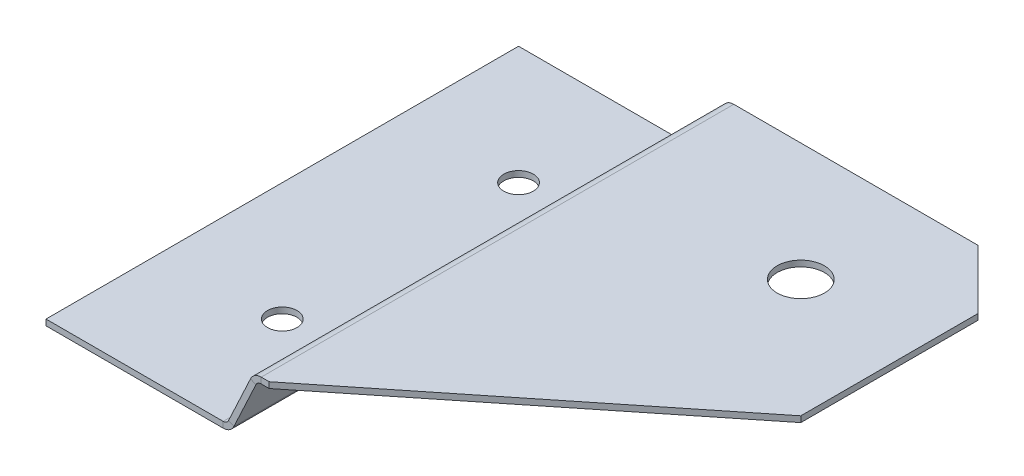
ISO-10303-21;
HEADER;
FILE_DESCRIPTION(('STEP AP214'),'2;1');
FILE_NAME('part.step','',(''),(''),'','','');
FILE_SCHEMA(('AUTOMOTIVE_DESIGN { 1 0 10303 214 1 1 1 1 }'));
ENDSEC;
DATA;
#1=APPLICATION_CONTEXT('core data for automotive mechanical design processes');
#2=APPLICATION_PROTOCOL_DEFINITION('international standard','automotive_design',2000,#1);
#3=PRODUCT_CONTEXT('',#1,'mechanical');
#4=PRODUCT('Part','Part','',(#3));
#5=PRODUCT_RELATED_PRODUCT_CATEGORY('part','',(#4));
#6=PRODUCT_DEFINITION_FORMATION('','',#4);
#7=PRODUCT_DEFINITION_CONTEXT('part definition',#1,'design');
#8=PRODUCT_DEFINITION('design','',#6,#7);
#9=PRODUCT_DEFINITION_SHAPE('','',#8);
#10=(LENGTH_UNIT() NAMED_UNIT(*) SI_UNIT(.MILLI.,.METRE.));
#11=(NAMED_UNIT(*) PLANE_ANGLE_UNIT() SI_UNIT($,.RADIAN.));
#12=(NAMED_UNIT(*) SI_UNIT($,.STERADIAN.) SOLID_ANGLE_UNIT());
#13=UNCERTAINTY_MEASURE_WITH_UNIT(LENGTH_MEASURE(1.E-05),#10,'distance_accuracy_value','');
#14=(GEOMETRIC_REPRESENTATION_CONTEXT(3) GLOBAL_UNCERTAINTY_ASSIGNED_CONTEXT((#13)) GLOBAL_UNIT_ASSIGNED_CONTEXT((#10,
#11,#12)) REPRESENTATION_CONTEXT('',''));
#15=CARTESIAN_POINT('',(0.,0.,0.));
#16=DIRECTION('',(0.,0.,1.));
#17=DIRECTION('',(1.,0.,0.));
#18=AXIS2_PLACEMENT_3D('',#15,#16,#17);
#19=CARTESIAN_POINT('',(-4.86211930977603,7.1183595245972,0.));
#20=DIRECTION('',(-0.906307787036651,0.422618261740697,0.));
#21=DIRECTION('',(0.,0.,1.));
#22=AXIS2_PLACEMENT_3D('',#19,#20,#21);
#23=PLANE('',#22);
#24=DIRECTION('',(0.422618261740697,0.906307787036651,0.));
#25=VECTOR('',#24,1.);
#26=CARTESIAN_POINT('',(-14.7936484606824,-14.1798734707641,20.));
#27=LINE('',#26,#25);
#28=CARTESIAN_POINT('',(-8.04684610648168,0.288690869129652,20.));
#29=VERTEX_POINT('',#28);
#30=CARTESIAN_POINT('',(-6.18790249035692,4.27520831874628,20.));
#31=VERTEX_POINT('',#30);
#32=EDGE_CURVE('E208',#29,#31,#27,.T.);
#33=ORIENTED_EDGE('',*,*,#32,.T.);
#34=DIRECTION('',(0.,0.,-1.));
#35=VECTOR('',#34,1.);
#36=CARTESIAN_POINT('',(-6.18790249035692,4.27520831874628,0.));
#37=LINE('',#36,#35);
#38=CARTESIAN_POINT('',(-6.18790249035693,4.27520831874628,-20.));
#39=VERTEX_POINT('',#38);
#40=EDGE_CURVE('E53',#31,#39,#37,.T.);
#41=ORIENTED_EDGE('',*,*,#40,.T.);
#42=DIRECTION('',(-0.422618261740697,-0.906307787036651,0.));
#43=VECTOR('',#42,1.);
#44=CARTESIAN_POINT('',(-14.7936484606824,-14.1798734707641,-20.));
#45=LINE('',#44,#43);
#46=CARTESIAN_POINT('',(-8.04684610648168,0.288690869129652,-20.));
#47=VERTEX_POINT('',#46);
#48=EDGE_CURVE('E269',#39,#47,#45,.T.);
#49=ORIENTED_EDGE('',*,*,#48,.T.);
#50=DIRECTION('',(0.,0.,-1.));
#51=VECTOR('',#50,1.);
#52=CARTESIAN_POINT('',(-8.04684610648168,0.288690869129653,0.));
#53=LINE('',#52,#51);
#54=EDGE_CURVE('E254',#29,#47,#53,.T.);
#55=ORIENTED_EDGE('',*,*,#54,.F.);
#56=EDGE_LOOP('',(#33,#41,#49,#55));
#57=FACE_BOUND('',#56,.T.);
#58=ADVANCED_FACE('F44',(#57),#23,.T.);
#59=CARTESIAN_POINT('',(-14.3404945671641,-14.3911826016345,20.));
#60=DIRECTION('',(0.,0.,1.));
#61=DIRECTION('',(0.422618261740697,0.906307787036651,0.));
#62=AXIS2_PLACEMENT_3D('',#59,#60,#61);
#63=PLANE('',#62);
#64=DIRECTION('',(0.422618261740697,0.906307787036651,0.));
#65=VECTOR('',#64,1.);
#66=CARTESIAN_POINT('',(-14.3404945671641,-14.3911826016345,20.));
#67=LINE('',#66,#65);
#68=CARTESIAN_POINT('',(-7.59369221296335,0.0773817382593027,20.));
#69=VERTEX_POINT('',#68);
#70=CARTESIAN_POINT('',(-5.7347485968386,4.06389918787593,20.));
#71=VERTEX_POINT('',#70);
#72=EDGE_CURVE('E266',#69,#71,#67,.T.);
#73=ORIENTED_EDGE('',*,*,#72,.T.);
#74=DIRECTION('',(-0.906307787036651,0.422618261740697,0.));
#75=VECTOR('',#74,1.);
#76=CARTESIAN_POINT('',(-5.7347485968386,4.06389918787594,20.));
#77=LINE('',#76,#75);
#78=EDGE_CURVE('E12',#71,#31,#77,.T.);
#79=ORIENTED_EDGE('',*,*,#78,.T.);
#80=ORIENTED_EDGE('',*,*,#32,.F.);
#81=DIRECTION('',(-0.906307787036651,0.422618261740697,0.));
#82=VECTOR('',#81,1.);
#83=CARTESIAN_POINT('',(-7.59369221296335,0.0773817382593031,20.));
#84=LINE('',#83,#82);
#85=EDGE_CURVE('E252',#69,#29,#84,.T.);
#86=ORIENTED_EDGE('',*,*,#85,.F.);
#87=EDGE_LOOP('',(#73,#79,#80,#86));
#88=FACE_BOUND('',#87,.T.);
#89=ADVANCED_FACE('F46',(#88),#63,.T.);
#90=CARTESIAN_POINT('',(-14.3404945671641,-14.3911826016344,-20.));
#91=DIRECTION('',(0.,0.,-1.));
#92=DIRECTION('',(-0.422618261740697,-0.906307787036651,0.));
#93=AXIS2_PLACEMENT_3D('',#90,#91,#92);
#94=PLANE('',#93);
#95=ORIENTED_EDGE('',*,*,#48,.F.);
#96=DIRECTION('',(0.906307787036651,-0.422618261740697,0.));
#97=VECTOR('',#96,1.);
#98=CARTESIAN_POINT('',(-5.7347485968386,4.06389918787594,-20.));
#99=LINE('',#98,#97);
#100=CARTESIAN_POINT('',(-5.7347485968386,4.06389918787593,-20.));
#101=VERTEX_POINT('',#100);
#102=EDGE_CURVE('E262',#39,#101,#99,.T.);
#103=ORIENTED_EDGE('',*,*,#102,.T.);
#104=DIRECTION('',(-0.422618261740697,-0.906307787036651,0.));
#105=VECTOR('',#104,1.);
#106=CARTESIAN_POINT('',(-14.3404945671641,-14.3911826016344,-20.));
#107=LINE('',#106,#105);
#108=CARTESIAN_POINT('',(-7.59369221296336,0.0773817382593049,-20.));
#109=VERTEX_POINT('',#108);
#110=EDGE_CURVE('E48',#101,#109,#107,.T.);
#111=ORIENTED_EDGE('',*,*,#110,.T.);
#112=DIRECTION('',(0.906307787036651,-0.422618261740697,0.));
#113=VECTOR('',#112,1.);
#114=CARTESIAN_POINT('',(-7.59369221296336,0.0773817382593049,-20.));
#115=LINE('',#114,#113);
#116=EDGE_CURVE('E257',#47,#109,#115,.T.);
#117=ORIENTED_EDGE('',*,*,#116,.F.);
#118=EDGE_LOOP('',(#95,#103,#111,#117));
#119=FACE_BOUND('',#118,.T.);
#120=ADVANCED_FACE('F287',(#119),#94,.T.);
#121=CARTESIAN_POINT('',(-4.4089654162577,6.90705039372686,0.));
#122=DIRECTION('',(-0.906307787036651,0.422618261740697,0.));
#123=DIRECTION('',(0.,0.,1.));
#124=AXIS2_PLACEMENT_3D('',#121,#122,#123);
#125=PLANE('',#124);
#126=DIRECTION('',(0.,0.,-1.));
#127=VECTOR('',#126,1.);
#128=CARTESIAN_POINT('',(-5.7347485968386,4.06389918787593,0.));
#129=LINE('',#128,#127);
#130=EDGE_CURVE('E260',#71,#101,#129,.T.);
#131=ORIENTED_EDGE('',*,*,#130,.F.);
#132=ORIENTED_EDGE('',*,*,#72,.F.);
#133=DIRECTION('',(0.,0.,-1.));
#134=VECTOR('',#133,1.);
#135=CARTESIAN_POINT('',(-7.59369221296335,0.0773817382593049,0.));
#136=LINE('',#135,#134);
#137=EDGE_CURVE('E249',#69,#109,#136,.T.);
#138=ORIENTED_EDGE('',*,*,#137,.T.);
#139=ORIENTED_EDGE('',*,*,#110,.F.);
#140=EDGE_LOOP('',(#131,#132,#138,#139));
#141=FACE_BOUND('',#140,.T.);
#142=ADVANCED_FACE('F285',(#141),#125,.F.);
#143=CARTESIAN_POINT('',(-13.5,-10.,-10.));
#144=DIRECTION('',(0.,1.,0.));
#145=DIRECTION('',(0.,0.,1.));
#146=AXIS2_PLACEMENT_3D('',#143,#144,#145);
#147=CYLINDRICAL_SURFACE('',#146,1.25);
#148=CARTESIAN_POINT('',(-13.5,0.,-10.));
#149=DIRECTION('',(0.,1.,0.));
#150=DIRECTION('',(0.,0.,1.));
#151=AXIS2_PLACEMENT_3D('',#148,#149,#150);
#152=CIRCLE('',#151,1.25);
#153=CARTESIAN_POINT('',(-13.5,0.,-8.75));
#154=VERTEX_POINT('',#153);
#155=EDGE_CURVE('E245',#154,#154,#152,.T.);
#156=ORIENTED_EDGE('',*,*,#155,.T.);
#157=EDGE_LOOP('',(#156));
#158=FACE_BOUND('',#157,.T.);
#159=CARTESIAN_POINT('',(-13.5,-0.5,-10.));
#160=DIRECTION('',(0.,1.,0.));
#161=DIRECTION('',(0.,0.,1.));
#162=AXIS2_PLACEMENT_3D('',#159,#160,#161);
#163=CIRCLE('',#162,1.25);
#164=CARTESIAN_POINT('',(-13.5,-0.5,-8.75));
#165=VERTEX_POINT('',#164);
#166=EDGE_CURVE('E231',#165,#165,#163,.T.);
#167=ORIENTED_EDGE('',*,*,#166,.F.);
#168=EDGE_LOOP('',(#167));
#169=FACE_BOUND('',#168,.T.);
#170=ADVANCED_FACE('F354',(#158,#169),#147,.F.);
#171=CARTESIAN_POINT('',(-13.5,-10.,10.));
#172=DIRECTION('',(0.,1.,0.));
#173=DIRECTION('',(0.,0.,1.));
#174=AXIS2_PLACEMENT_3D('',#171,#172,#173);
#175=CYLINDRICAL_SURFACE('',#174,1.25);
#176=CARTESIAN_POINT('',(-13.5,0.,10.));
#177=DIRECTION('',(0.,1.,0.));
#178=DIRECTION('',(0.,0.,1.));
#179=AXIS2_PLACEMENT_3D('',#176,#177,#178);
#180=CIRCLE('',#179,1.25);
#181=CARTESIAN_POINT('',(-13.5,0.,11.25));
#182=VERTEX_POINT('',#181);
#183=EDGE_CURVE('E242',#182,#182,#180,.T.);
#184=ORIENTED_EDGE('',*,*,#183,.T.);
#185=EDGE_LOOP('',(#184));
#186=FACE_BOUND('',#185,.T.);
#187=CARTESIAN_POINT('',(-13.5,-0.5,10.));
#188=DIRECTION('',(0.,1.,0.));
#189=DIRECTION('',(0.,0.,1.));
#190=AXIS2_PLACEMENT_3D('',#187,#188,#189);
#191=CIRCLE('',#190,1.25);
#192=CARTESIAN_POINT('',(-13.5,-0.5,11.25));
#193=VERTEX_POINT('',#192);
#194=EDGE_CURVE('E234',#193,#193,#191,.T.);
#195=ORIENTED_EDGE('',*,*,#194,.F.);
#196=EDGE_LOOP('',(#195));
#197=FACE_BOUND('',#196,.T.);
#198=ADVANCED_FACE('F375',(#186,#197),#175,.F.);
#199=CARTESIAN_POINT('',(-23.5,-0.5,-20.));
#200=DIRECTION('',(-1.,0.,0.));
#201=DIRECTION('',(0.,0.,1.));
#202=AXIS2_PLACEMENT_3D('',#199,#200,#201);
#203=PLANE('',#202);
#204=DIRECTION('',(0.,0.,1.));
#205=VECTOR('',#204,1.);
#206=CARTESIAN_POINT('',(-23.5,0.,-20.));
#207=LINE('',#206,#205);
#208=CARTESIAN_POINT('',(-23.5,0.,-20.));
#209=VERTEX_POINT('',#208);
#210=CARTESIAN_POINT('',(-23.5,0.,20.));
#211=VERTEX_POINT('',#210);
#212=EDGE_CURVE('E214',#209,#211,#207,.T.);
#213=ORIENTED_EDGE('',*,*,#212,.F.);
#214=DIRECTION('',(0.,1.,0.));
#215=VECTOR('',#214,1.);
#216=CARTESIAN_POINT('',(-23.5,-0.5,-20.));
#217=LINE('',#216,#215);
#218=CARTESIAN_POINT('',(-23.5,-0.5,-20.));
#219=VERTEX_POINT('',#218);
#220=EDGE_CURVE('E205',#219,#209,#217,.T.);
#221=ORIENTED_EDGE('',*,*,#220,.F.);
#222=DIRECTION('',(0.,0.,1.));
#223=VECTOR('',#222,1.);
#224=CARTESIAN_POINT('',(-23.5,-0.5,-20.));
#225=LINE('',#224,#223);
#226=CARTESIAN_POINT('',(-23.5,-0.5,20.));
#227=VERTEX_POINT('',#226);
#228=EDGE_CURVE('E239',#219,#227,#225,.T.);
#229=ORIENTED_EDGE('',*,*,#228,.T.);
#230=DIRECTION('',(0.,1.,0.));
#231=VECTOR('',#230,1.);
#232=CARTESIAN_POINT('',(-23.5,-0.5,20.));
#233=LINE('',#232,#231);
#234=EDGE_CURVE('E237',#227,#211,#233,.T.);
#235=ORIENTED_EDGE('',*,*,#234,.T.);
#236=EDGE_LOOP('',(#213,#221,#229,#235));
#237=FACE_BOUND('',#236,.T.);
#238=ADVANCED_FACE('F371',(#237),#203,.T.);
#239=CARTESIAN_POINT('',(0.,-0.5,0.));
#240=DIRECTION('',(0.,1.,0.));
#241=DIRECTION('',(0.,0.,1.));
#242=AXIS2_PLACEMENT_3D('',#239,#240,#241);
#243=PLANE('',#242);
#244=DIRECTION('',(0.,0.,-1.));
#245=VECTOR('',#244,1.);
#246=CARTESIAN_POINT('',(-8.50000000000001,-0.5,0.));
#247=LINE('',#246,#245);
#248=CARTESIAN_POINT('',(-8.5,-0.500000000000001,20.));
#249=VERTEX_POINT('',#248);
#250=CARTESIAN_POINT('',(-8.5,-0.5,-20.));
#251=VERTEX_POINT('',#250);
#252=EDGE_CURVE('E201',#249,#251,#247,.T.);
#253=ORIENTED_EDGE('',*,*,#252,.F.);
#254=DIRECTION('',(1.,0.,0.));
#255=VECTOR('',#254,1.);
#256=CARTESIAN_POINT('',(-23.5,-0.5,20.));
#257=LINE('',#256,#255);
#258=EDGE_CURVE('E228',#227,#249,#257,.T.);
#259=ORIENTED_EDGE('',*,*,#258,.F.);
#260=ORIENTED_EDGE('',*,*,#228,.F.);
#261=DIRECTION('',(-1.,0.,0.));
#262=VECTOR('',#261,1.);
#263=CARTESIAN_POINT('',(-23.5,-0.5,-20.));
#264=LINE('',#263,#262);
#265=EDGE_CURVE('E209',#251,#219,#264,.T.);
#266=ORIENTED_EDGE('',*,*,#265,.F.);
#267=EDGE_LOOP('',(#253,#259,#260,#266));
#268=FACE_BOUND('',#267,.T.);
#269=ORIENTED_EDGE('',*,*,#194,.T.);
#270=EDGE_LOOP('',(#269));
#271=FACE_BOUND('',#270,.T.);
#272=ORIENTED_EDGE('',*,*,#166,.T.);
#273=EDGE_LOOP('',(#272));
#274=FACE_BOUND('',#273,.T.);
#275=ADVANCED_FACE('F367',(#268,#271,#274),#243,.F.);
#276=CARTESIAN_POINT('',(-23.5,-0.5,20.));
#277=DIRECTION('',(0.,0.,1.));
#278=DIRECTION('',(1.,0.,0.));
#279=AXIS2_PLACEMENT_3D('',#276,#277,#278);
#280=PLANE('',#279);
#281=ORIENTED_EDGE('',*,*,#258,.T.);
#282=DIRECTION('',(0.,1.,0.));
#283=VECTOR('',#282,1.);
#284=CARTESIAN_POINT('',(-8.5,-0.5,20.));
#285=LINE('',#284,#283);
#286=CARTESIAN_POINT('',(-8.5,0.,20.));
#287=VERTEX_POINT('',#286);
#288=EDGE_CURVE('E225',#249,#287,#285,.T.);
#289=ORIENTED_EDGE('',*,*,#288,.T.);
#290=DIRECTION('',(1.,0.,0.));
#291=VECTOR('',#290,1.);
#292=CARTESIAN_POINT('',(-23.5,0.,20.));
#293=LINE('',#292,#291);
#294=EDGE_CURVE('E222',#211,#287,#293,.T.);
#295=ORIENTED_EDGE('',*,*,#294,.F.);
#296=ORIENTED_EDGE('',*,*,#234,.F.);
#297=EDGE_LOOP('',(#281,#289,#295,#296));
#298=FACE_BOUND('',#297,.T.);
#299=ADVANCED_FACE('F363',(#298),#280,.T.);
#300=CARTESIAN_POINT('',(0.,0.,0.));
#301=DIRECTION('',(0.,1.,0.));
#302=DIRECTION('',(0.,0.,1.));
#303=AXIS2_PLACEMENT_3D('',#300,#301,#302);
#304=PLANE('',#303);
#305=ORIENTED_EDGE('',*,*,#155,.F.);
#306=EDGE_LOOP('',(#305));
#307=FACE_BOUND('',#306,.T.);
#308=ORIENTED_EDGE('',*,*,#183,.F.);
#309=EDGE_LOOP('',(#308));
#310=FACE_BOUND('',#309,.T.);
#311=ORIENTED_EDGE('',*,*,#294,.T.);
#312=DIRECTION('',(0.,0.,-1.));
#313=VECTOR('',#312,1.);
#314=CARTESIAN_POINT('',(-8.50000000000001,0.,0.));
#315=LINE('',#314,#313);
#316=CARTESIAN_POINT('',(-8.50000000000001,0.,-20.));
#317=VERTEX_POINT('',#316);
#318=EDGE_CURVE('E219',#287,#317,#315,.T.);
#319=ORIENTED_EDGE('',*,*,#318,.T.);
#320=DIRECTION('',(-1.,0.,0.));
#321=VECTOR('',#320,1.);
#322=CARTESIAN_POINT('',(-23.5,0.,-20.));
#323=LINE('',#322,#321);
#324=EDGE_CURVE('E217',#317,#209,#323,.T.);
#325=ORIENTED_EDGE('',*,*,#324,.T.);
#326=ORIENTED_EDGE('',*,*,#212,.T.);
#327=EDGE_LOOP('',(#311,#319,#325,#326));
#328=FACE_BOUND('',#327,.T.);
#329=ADVANCED_FACE('F359',(#307,#310,#328),#304,.T.);
#330=CARTESIAN_POINT('',(-23.5,-0.5,-20.));
#331=DIRECTION('',(0.,0.,-1.));
#332=DIRECTION('',(-1.,0.,0.));
#333=AXIS2_PLACEMENT_3D('',#330,#331,#332);
#334=PLANE('',#333);
#335=ORIENTED_EDGE('',*,*,#324,.F.);
#336=DIRECTION('',(0.,-1.,0.));
#337=VECTOR('',#336,1.);
#338=CARTESIAN_POINT('',(-8.50000000000001,-0.5,-20.));
#339=LINE('',#338,#337);
#340=EDGE_CURVE('E211',#317,#251,#339,.T.);
#341=ORIENTED_EDGE('',*,*,#340,.T.);
#342=ORIENTED_EDGE('',*,*,#265,.T.);
#343=ORIENTED_EDGE('',*,*,#220,.T.);
#344=EDGE_LOOP('',(#335,#341,#342,#343));
#345=FACE_BOUND('',#344,.T.);
#346=ADVANCED_FACE('F355',(#345),#334,.T.);
#347=CARTESIAN_POINT('',(-8.5,0.5,20.));
#348=DIRECTION('',(0.,0.,1.));
#349=DIRECTION('',(1.,0.,0.));
#350=AXIS2_PLACEMENT_3D('',#347,#348,#349);
#351=PLANE('',#350);
#352=ORIENTED_EDGE('',*,*,#85,.T.);
#353=CARTESIAN_POINT('',(-8.5,0.5,20.));
#354=DIRECTION('',(0.,0.,1.));
#355=DIRECTION('',(1.,0.,0.));
#356=AXIS2_PLACEMENT_3D('',#353,#354,#355);
#357=CIRCLE('',#356,0.5);
#358=EDGE_CURVE('E191',#29,#287,#357,.F.);
#359=ORIENTED_EDGE('',*,*,#358,.T.);
#360=ORIENTED_EDGE('',*,*,#288,.F.);
#361=CARTESIAN_POINT('',(-8.5,0.5,20.));
#362=DIRECTION('',(0.,0.,-1.));
#363=DIRECTION('',(1.,0.,0.));
#364=AXIS2_PLACEMENT_3D('',#361,#362,#363);
#365=CIRCLE('',#364,1.);
#366=EDGE_CURVE('E195',#69,#249,#365,.T.);
#367=ORIENTED_EDGE('',*,*,#366,.F.);
#368=EDGE_LOOP('',(#352,#359,#360,#367));
#369=FACE_BOUND('',#368,.T.);
#370=ADVANCED_FACE('F358',(#369),#351,.T.);
#371=CARTESIAN_POINT('',(-8.50000000000001,0.5,-20.));
#372=DIRECTION('',(0.,0.,-1.));
#373=DIRECTION('',(-1.,0.,0.));
#374=AXIS2_PLACEMENT_3D('',#371,#372,#373);
#375=PLANE('',#374);
#376=CARTESIAN_POINT('',(-8.50000000000001,0.5,-20.));
#377=DIRECTION('',(0.,0.,1.));
#378=DIRECTION('',(1.,0.,0.));
#379=AXIS2_PLACEMENT_3D('',#376,#377,#378);
#380=CIRCLE('',#379,0.5);
#381=EDGE_CURVE('E199',#317,#47,#380,.T.);
#382=ORIENTED_EDGE('',*,*,#381,.T.);
#383=ORIENTED_EDGE('',*,*,#116,.T.);
#384=CARTESIAN_POINT('',(-8.50000000000001,0.5,-20.));
#385=DIRECTION('',(0.,0.,1.));
#386=DIRECTION('',(-1.,0.,0.));
#387=AXIS2_PLACEMENT_3D('',#384,#385,#386);
#388=CIRCLE('',#387,1.);
#389=EDGE_CURVE('E198',#251,#109,#388,.T.);
#390=ORIENTED_EDGE('',*,*,#389,.F.);
#391=ORIENTED_EDGE('',*,*,#340,.F.);
#392=EDGE_LOOP('',(#382,#383,#390,#391));
#393=FACE_BOUND('',#392,.T.);
#394=ADVANCED_FACE('F383',(#393),#375,.T.);
#395=CARTESIAN_POINT('',(-8.50000000000001,0.5,-40.014745578505));
#396=DIRECTION('',(0.,0.,1.));
#397=DIRECTION('',(1.,0.,0.));
#398=AXIS2_PLACEMENT_3D('',#395,#396,#397);
#399=CYLINDRICAL_SURFACE('',#398,1.);
#400=ORIENTED_EDGE('',*,*,#252,.T.);
#401=ORIENTED_EDGE('',*,*,#389,.T.);
#402=ORIENTED_EDGE('',*,*,#137,.F.);
#403=ORIENTED_EDGE('',*,*,#366,.T.);
#404=EDGE_LOOP('',(#400,#401,#402,#403));
#405=FACE_BOUND('',#404,.T.);
#406=ADVANCED_FACE('F386',(#405),#399,.T.);
#407=CARTESIAN_POINT('',(-8.50000000000001,0.5,-40.014745578505));
#408=DIRECTION('',(0.,0.,1.));
#409=DIRECTION('',(1.,0.,0.));
#410=AXIS2_PLACEMENT_3D('',#407,#408,#409);
#411=CYLINDRICAL_SURFACE('',#410,0.5);
#412=ORIENTED_EDGE('',*,*,#318,.F.);
#413=ORIENTED_EDGE('',*,*,#358,.F.);
#414=ORIENTED_EDGE('',*,*,#54,.T.);
#415=ORIENTED_EDGE('',*,*,#381,.F.);
#416=EDGE_LOOP('',(#412,#413,#414,#415));
#417=FACE_BOUND('',#416,.T.);
#418=ADVANCED_FACE('F391',(#417),#411,.F.);
#419=CARTESIAN_POINT('',(-5.28159470332027,3.85259005700558,20.));
#420=DIRECTION('',(0.,0.,-1.));
#421=DIRECTION('',(-1.,0.,0.));
#422=AXIS2_PLACEMENT_3D('',#419,#420,#421);
#423=PLANE('',#422);
#424=DIRECTION('',(0.,1.,0.));
#425=VECTOR('',#424,1.);
#426=CARTESIAN_POINT('',(-5.28159470332027,4.35259005700559,20.));
#427=LINE('',#426,#425);
#428=CARTESIAN_POINT('',(-5.28159470332027,4.35259005700558,20.));
#429=VERTEX_POINT('',#428);
#430=CARTESIAN_POINT('',(-5.28159470332027,4.85259005700558,20.));
#431=VERTEX_POINT('',#430);
#432=EDGE_CURVE('E154',#429,#431,#427,.T.);
#433=ORIENTED_EDGE('',*,*,#432,.T.);
#434=CARTESIAN_POINT('',(-5.28159470332027,3.85259005700558,20.));
#435=DIRECTION('',(0.,0.,1.));
#436=DIRECTION('',(1.,0.,0.));
#437=AXIS2_PLACEMENT_3D('',#434,#435,#436);
#438=CIRCLE('',#437,1.);
#439=EDGE_CURVE('E61',#431,#31,#438,.T.);
#440=ORIENTED_EDGE('',*,*,#439,.T.);
#441=ORIENTED_EDGE('',*,*,#78,.F.);
#442=CARTESIAN_POINT('',(-5.28159470332027,3.85259005700558,20.));
#443=DIRECTION('',(0.,0.,1.));
#444=DIRECTION('',(-1.,0.,0.));
#445=AXIS2_PLACEMENT_3D('',#442,#443,#444);
#446=CIRCLE('',#445,0.5);
#447=EDGE_CURVE('E184',#429,#71,#446,.T.);
#448=ORIENTED_EDGE('',*,*,#447,.F.);
#449=EDGE_LOOP('',(#433,#440,#441,#448));
#450=FACE_BOUND('',#449,.T.);
#451=ADVANCED_FACE('F278',(#450),#423,.F.);
#452=CARTESIAN_POINT('',(-5.28159470332028,3.85259005700559,-20.));
#453=DIRECTION('',(0.,0.,1.));
#454=DIRECTION('',(1.,0.,0.));
#455=AXIS2_PLACEMENT_3D('',#452,#453,#454);
#456=PLANE('',#455);
#457=CARTESIAN_POINT('',(-5.28159470332028,3.85259005700559,-20.));
#458=DIRECTION('',(0.,0.,1.));
#459=DIRECTION('',(1.,0.,0.));
#460=AXIS2_PLACEMENT_3D('',#457,#458,#459);
#461=CIRCLE('',#460,1.);
#462=CARTESIAN_POINT('',(-5.28159470332027,4.85259005700558,-20.));
#463=VERTEX_POINT('',#462);
#464=EDGE_CURVE('E188',#39,#463,#461,.F.);
#465=ORIENTED_EDGE('',*,*,#464,.T.);
#466=DIRECTION('',(0.,-1.,0.));
#467=VECTOR('',#466,1.);
#468=CARTESIAN_POINT('',(-5.28159470332027,4.35259005700559,-20.));
#469=LINE('',#468,#467);
#470=CARTESIAN_POINT('',(-5.28159470332027,4.35259005700558,-20.));
#471=VERTEX_POINT('',#470);
#472=EDGE_CURVE('E173',#463,#471,#469,.T.);
#473=ORIENTED_EDGE('',*,*,#472,.T.);
#474=CARTESIAN_POINT('',(-5.28159470332028,3.85259005700559,-20.));
#475=DIRECTION('',(0.,0.,-1.));
#476=DIRECTION('',(1.,0.,0.));
#477=AXIS2_PLACEMENT_3D('',#474,#475,#476);
#478=CIRCLE('',#477,0.5);
#479=EDGE_CURVE('E187',#101,#471,#478,.T.);
#480=ORIENTED_EDGE('',*,*,#479,.F.);
#481=ORIENTED_EDGE('',*,*,#102,.F.);
#482=EDGE_LOOP('',(#465,#473,#480,#481));
#483=FACE_BOUND('',#482,.T.);
#484=ADVANCED_FACE('F290',(#483),#456,.F.);
#485=CARTESIAN_POINT('',(-5.28159470332028,3.85259005700559,-40.0239747662338));
#486=DIRECTION('',(0.,0.,1.));
#487=DIRECTION('',(1.,0.,0.));
#488=AXIS2_PLACEMENT_3D('',#485,#486,#487);
#489=CYLINDRICAL_SURFACE('',#488,0.5);
#490=ORIENTED_EDGE('',*,*,#130,.T.);
#491=ORIENTED_EDGE('',*,*,#479,.T.);
#492=DIRECTION('',(0.,0.,-1.));
#493=VECTOR('',#492,1.);
#494=CARTESIAN_POINT('',(-5.28159470332027,4.35259005700558,0.));
#495=LINE('',#494,#493);
#496=EDGE_CURVE('E283',#429,#471,#495,.T.);
#497=ORIENTED_EDGE('',*,*,#496,.F.);
#498=ORIENTED_EDGE('',*,*,#447,.T.);
#499=EDGE_LOOP('',(#490,#491,#497,#498));
#500=FACE_BOUND('',#499,.T.);
#501=ADVANCED_FACE('F281',(#500),#489,.F.);
#502=CARTESIAN_POINT('',(-5.28159470332028,3.85259005700559,-40.0239747662338));
#503=DIRECTION('',(0.,0.,1.));
#504=DIRECTION('',(1.,0.,0.));
#505=AXIS2_PLACEMENT_3D('',#502,#503,#504);
#506=CYLINDRICAL_SURFACE('',#505,1.);
#507=ORIENTED_EDGE('',*,*,#40,.F.);
#508=ORIENTED_EDGE('',*,*,#439,.F.);
#509=DIRECTION('',(0.,0.,-1.));
#510=VECTOR('',#509,1.);
#511=CARTESIAN_POINT('',(-5.28159470332027,4.85259005700558,0.));
#512=LINE('',#511,#510);
#513=EDGE_CURVE('E177',#431,#463,#512,.T.);
#514=ORIENTED_EDGE('',*,*,#513,.T.);
#515=ORIENTED_EDGE('',*,*,#464,.F.);
#516=EDGE_LOOP('',(#507,#508,#514,#515));
#517=FACE_BOUND('',#516,.T.);
#518=ADVANCED_FACE('F292',(#517),#506,.T.);
#519=CARTESIAN_POINT('',(-4.60881885423965,4.35259005700558,20.));
#520=DIRECTION('',(0.624695047554425,0.,0.78086880944303));
#521=DIRECTION('',(0.78086880944303,0.,-0.624695047554425));
#522=AXIS2_PLACEMENT_3D('',#519,#520,#521);
#523=PLANE('',#522);
#524=DIRECTION('',(0.78086880944303,0.,-0.624695047554424));
#525=VECTOR('',#524,1.);
#526=CARTESIAN_POINT('',(-4.60881885423965,4.85259005700558,20.));
#527=LINE('',#526,#525);
#528=CARTESIAN_POINT('',(-4.60881885423965,4.85259005700558,20.));
#529=VERTEX_POINT('',#528);
#530=CARTESIAN_POINT('',(20.3911811457603,4.85259005700558,0.));
#531=VERTEX_POINT('',#530);
#532=EDGE_CURVE('E165',#529,#531,#527,.T.);
#533=ORIENTED_EDGE('',*,*,#532,.F.);
#534=DIRECTION('',(0.,1.,0.));
#535=VECTOR('',#534,1.);
#536=CARTESIAN_POINT('',(-4.60881885423965,4.35259005700558,20.));
#537=LINE('',#536,#535);
#538=CARTESIAN_POINT('',(-4.60881885423965,4.35259005700558,20.));
#539=VERTEX_POINT('',#538);
#540=EDGE_CURVE('E152',#539,#529,#537,.T.);
#541=ORIENTED_EDGE('',*,*,#540,.F.);
#542=DIRECTION('',(0.78086880944303,0.,-0.624695047554424));
#543=VECTOR('',#542,1.);
#544=CARTESIAN_POINT('',(-4.60881885423965,4.35259005700558,20.));
#545=LINE('',#544,#543);
#546=CARTESIAN_POINT('',(20.3911811457603,4.35259005700558,0.));
#547=VERTEX_POINT('',#546);
#548=EDGE_CURVE('E163',#539,#547,#545,.T.);
#549=ORIENTED_EDGE('',*,*,#548,.T.);
#550=DIRECTION('',(0.,1.,0.));
#551=VECTOR('',#550,1.);
#552=CARTESIAN_POINT('',(20.3911811457603,4.35259005700558,0.));
#553=LINE('',#552,#551);
#554=EDGE_CURVE('E172',#547,#531,#553,.T.);
#555=ORIENTED_EDGE('',*,*,#554,.T.);
#556=EDGE_LOOP('',(#533,#541,#549,#555));
#557=FACE_BOUND('',#556,.T.);
#558=ADVANCED_FACE('F162',(#557),#523,.T.);
#559=CARTESIAN_POINT('',(20.3911811457603,4.35259005700559,-15.));
#560=DIRECTION('',(1.,0.,0.));
#561=DIRECTION('',(0.,0.,-1.));
#562=AXIS2_PLACEMENT_3D('',#559,#560,#561);
#563=PLANE('',#562);
#564=DIRECTION('',(0.,0.,-1.));
#565=VECTOR('',#564,1.);
#566=CARTESIAN_POINT('',(20.3911811457603,4.85259005700559,-15.));
#567=LINE('',#566,#565);
#568=CARTESIAN_POINT('',(20.3911811457603,4.85259005700559,-15.));
#569=VERTEX_POINT('',#568);
#570=EDGE_CURVE('E330',#531,#569,#567,.T.);
#571=ORIENTED_EDGE('',*,*,#570,.F.);
#572=ORIENTED_EDGE('',*,*,#554,.F.);
#573=DIRECTION('',(0.,0.,-1.));
#574=VECTOR('',#573,1.);
#575=CARTESIAN_POINT('',(20.3911811457603,4.35259005700559,-15.));
#576=LINE('',#575,#574);
#577=CARTESIAN_POINT('',(20.3911811457603,4.35259005700559,-15.));
#578=VERTEX_POINT('',#577);
#579=EDGE_CURVE('E171',#547,#578,#576,.T.);
#580=ORIENTED_EDGE('',*,*,#579,.T.);
#581=DIRECTION('',(0.,1.,0.));
#582=VECTOR('',#581,1.);
#583=CARTESIAN_POINT('',(20.3911811457603,4.35259005700559,-15.));
#584=LINE('',#583,#582);
#585=EDGE_CURVE('E326',#578,#569,#584,.T.);
#586=ORIENTED_EDGE('',*,*,#585,.T.);
#587=EDGE_LOOP('',(#571,#572,#580,#586));
#588=FACE_BOUND('',#587,.T.);
#589=ADVANCED_FACE('F329',(#588),#563,.T.);
#590=CARTESIAN_POINT('',(15.3911811457603,4.35259005700559,-20.));
#591=DIRECTION('',(0.707106781186548,0.,-0.707106781186548));
#592=DIRECTION('',(-0.707106781186548,0.,-0.707106781186547));
#593=AXIS2_PLACEMENT_3D('',#590,#591,#592);
#594=PLANE('',#593);
#595=DIRECTION('',(-0.707106781186548,0.,-0.707106781186547));
#596=VECTOR('',#595,1.);
#597=CARTESIAN_POINT('',(15.3911811457603,4.85259005700559,-20.));
#598=LINE('',#597,#596);
#599=CARTESIAN_POINT('',(15.3911811457603,4.85259005700559,-20.));
#600=VERTEX_POINT('',#599);
#601=EDGE_CURVE('E303',#569,#600,#598,.T.);
#602=ORIENTED_EDGE('',*,*,#601,.F.);
#603=ORIENTED_EDGE('',*,*,#585,.F.);
#604=DIRECTION('',(-0.707106781186548,0.,-0.707106781186547));
#605=VECTOR('',#604,1.);
#606=CARTESIAN_POINT('',(15.3911811457603,4.35259005700559,-20.));
#607=LINE('',#606,#605);
#608=CARTESIAN_POINT('',(15.3911811457603,4.35259005700559,-20.));
#609=VERTEX_POINT('',#608);
#610=EDGE_CURVE('E324',#578,#609,#607,.T.);
#611=ORIENTED_EDGE('',*,*,#610,.T.);
#612=DIRECTION('',(0.,1.,0.));
#613=VECTOR('',#612,1.);
#614=CARTESIAN_POINT('',(15.3911811457603,4.35259005700559,-20.));
#615=LINE('',#614,#613);
#616=EDGE_CURVE('E310',#609,#600,#615,.T.);
#617=ORIENTED_EDGE('',*,*,#616,.T.);
#618=EDGE_LOOP('',(#602,#603,#611,#617));
#619=FACE_BOUND('',#618,.T.);
#620=ADVANCED_FACE('F334',(#619),#594,.T.);
#621=CARTESIAN_POINT('',(10.3911811457604,-5.14740994299442,-10.));
#622=DIRECTION('',(0.,1.,0.));
#623=DIRECTION('',(0.,0.,1.));
#624=AXIS2_PLACEMENT_3D('',#621,#622,#623);
#625=CYLINDRICAL_SURFACE('',#624,2.);
#626=CARTESIAN_POINT('',(10.3911811457603,4.85259005700558,-10.));
#627=DIRECTION('',(0.,1.,0.));
#628=DIRECTION('',(0.,0.,1.));
#629=AXIS2_PLACEMENT_3D('',#626,#627,#628);
#630=CIRCLE('',#629,2.);
#631=CARTESIAN_POINT('',(10.3911811457603,4.85259005700558,-7.99999999999999));
#632=VERTEX_POINT('',#631);
#633=EDGE_CURVE('E320',#632,#632,#630,.T.);
#634=ORIENTED_EDGE('',*,*,#633,.T.);
#635=EDGE_LOOP('',(#634));
#636=FACE_BOUND('',#635,.T.);
#637=CARTESIAN_POINT('',(10.3911811457603,4.35259005700558,-10.));
#638=DIRECTION('',(0.,1.,0.));
#639=DIRECTION('',(0.,0.,1.));
#640=AXIS2_PLACEMENT_3D('',#637,#638,#639);
#641=CIRCLE('',#640,2.);
#642=CARTESIAN_POINT('',(10.3911811457603,4.35259005700558,-7.99999999999999));
#643=VERTEX_POINT('',#642);
#644=EDGE_CURVE('E314',#643,#643,#641,.T.);
#645=ORIENTED_EDGE('',*,*,#644,.F.);
#646=EDGE_LOOP('',(#645));
#647=FACE_BOUND('',#646,.T.);
#648=ADVANCED_FACE('F336',(#636,#647),#625,.F.);
#649=CARTESIAN_POINT('',(-3.10881885423965,4.35259005700558,0.));
#650=DIRECTION('',(0.,1.,0.));
#651=DIRECTION('',(0.,0.,1.));
#652=AXIS2_PLACEMENT_3D('',#649,#650,#651);
#653=PLANE('',#652);
#654=ORIENTED_EDGE('',*,*,#644,.T.);
#655=EDGE_LOOP('',(#654));
#656=FACE_BOUND('',#655,.T.);
#657=DIRECTION('',(1.,0.,0.));
#658=VECTOR('',#657,1.);
#659=CARTESIAN_POINT('',(-26.6088188542397,4.35259005700558,20.));
#660=LINE('',#659,#658);
#661=EDGE_CURVE('E149',#429,#539,#660,.T.);
#662=ORIENTED_EDGE('',*,*,#661,.F.);
#663=ORIENTED_EDGE('',*,*,#496,.T.);
#664=DIRECTION('',(-1.,0.,0.));
#665=VECTOR('',#664,1.);
#666=CARTESIAN_POINT('',(-26.6088188542397,4.35259005700559,-20.));
#667=LINE('',#666,#665);
#668=EDGE_CURVE('E309',#609,#471,#667,.T.);
#669=ORIENTED_EDGE('',*,*,#668,.F.);
#670=ORIENTED_EDGE('',*,*,#610,.F.);
#671=ORIENTED_EDGE('',*,*,#579,.F.);
#672=ORIENTED_EDGE('',*,*,#548,.F.);
#673=EDGE_LOOP('',(#662,#663,#669,#670,#671,#672));
#674=FACE_BOUND('',#673,.T.);
#675=ADVANCED_FACE('F168',(#656,#674),#653,.F.);
#676=CARTESIAN_POINT('',(-26.6088188542397,4.35259005700559,-20.));
#677=DIRECTION('',(0.,0.,-1.));
#678=DIRECTION('',(-1.,0.,0.));
#679=AXIS2_PLACEMENT_3D('',#676,#677,#678);
#680=PLANE('',#679);
#681=ORIENTED_EDGE('',*,*,#472,.F.);
#682=DIRECTION('',(-1.,0.,0.));
#683=VECTOR('',#682,1.);
#684=CARTESIAN_POINT('',(-26.6088188542397,4.85259005700558,-20.));
#685=LINE('',#684,#683);
#686=EDGE_CURVE('E158',#600,#463,#685,.T.);
#687=ORIENTED_EDGE('',*,*,#686,.F.);
#688=ORIENTED_EDGE('',*,*,#616,.F.);
#689=ORIENTED_EDGE('',*,*,#668,.T.);
#690=EDGE_LOOP('',(#681,#687,#688,#689));
#691=FACE_BOUND('',#690,.T.);
#692=ADVANCED_FACE('F307',(#691),#680,.T.);
#693=CARTESIAN_POINT('',(-3.10881885423965,4.85259005700558,0.));
#694=DIRECTION('',(0.,1.,0.));
#695=DIRECTION('',(0.,0.,1.));
#696=AXIS2_PLACEMENT_3D('',#693,#694,#695);
#697=PLANE('',#696);
#698=ORIENTED_EDGE('',*,*,#513,.F.);
#699=DIRECTION('',(1.,0.,0.));
#700=VECTOR('',#699,1.);
#701=CARTESIAN_POINT('',(-26.6088188542397,4.85259005700558,20.));
#702=LINE('',#701,#700);
#703=EDGE_CURVE('E297',#431,#529,#702,.T.);
#704=ORIENTED_EDGE('',*,*,#703,.T.);
#705=ORIENTED_EDGE('',*,*,#532,.T.);
#706=ORIENTED_EDGE('',*,*,#570,.T.);
#707=ORIENTED_EDGE('',*,*,#601,.T.);
#708=ORIENTED_EDGE('',*,*,#686,.T.);
#709=EDGE_LOOP('',(#698,#704,#705,#706,#707,#708));
#710=FACE_BOUND('',#709,.T.);
#711=ORIENTED_EDGE('',*,*,#633,.F.);
#712=EDGE_LOOP('',(#711));
#713=FACE_BOUND('',#712,.T.);
#714=ADVANCED_FACE('F295',(#710,#713),#697,.T.);
#715=CARTESIAN_POINT('',(-26.6088188542397,4.35259005700558,20.));
#716=DIRECTION('',(0.,0.,1.));
#717=DIRECTION('',(1.,0.,0.));
#718=AXIS2_PLACEMENT_3D('',#715,#716,#717);
#719=PLANE('',#718);
#720=ORIENTED_EDGE('',*,*,#432,.F.);
#721=ORIENTED_EDGE('',*,*,#661,.T.);
#722=ORIENTED_EDGE('',*,*,#540,.T.);
#723=ORIENTED_EDGE('',*,*,#703,.F.);
#724=EDGE_LOOP('',(#720,#721,#722,#723));
#725=FACE_BOUND('',#724,.T.);
#726=ADVANCED_FACE('F151',(#725),#719,.T.);
#727=CLOSED_SHELL('',(#58,#89,#120,#142,#170,#198,#238,#275,#299,#329,#346,#370,#394,#406,#418,
#451,#484,#501,#518,#558,#589,#620,#648,#675,#692,#714,#726));
#728=MANIFOLD_SOLID_BREP('B2',#727);
#729=ADVANCED_BREP_SHAPE_REPRESENTATION('',(#18,#728),#14);
#730=SHAPE_DEFINITION_REPRESENTATION(#9,#729);
ENDSEC;
END-ISO-10303-21;
